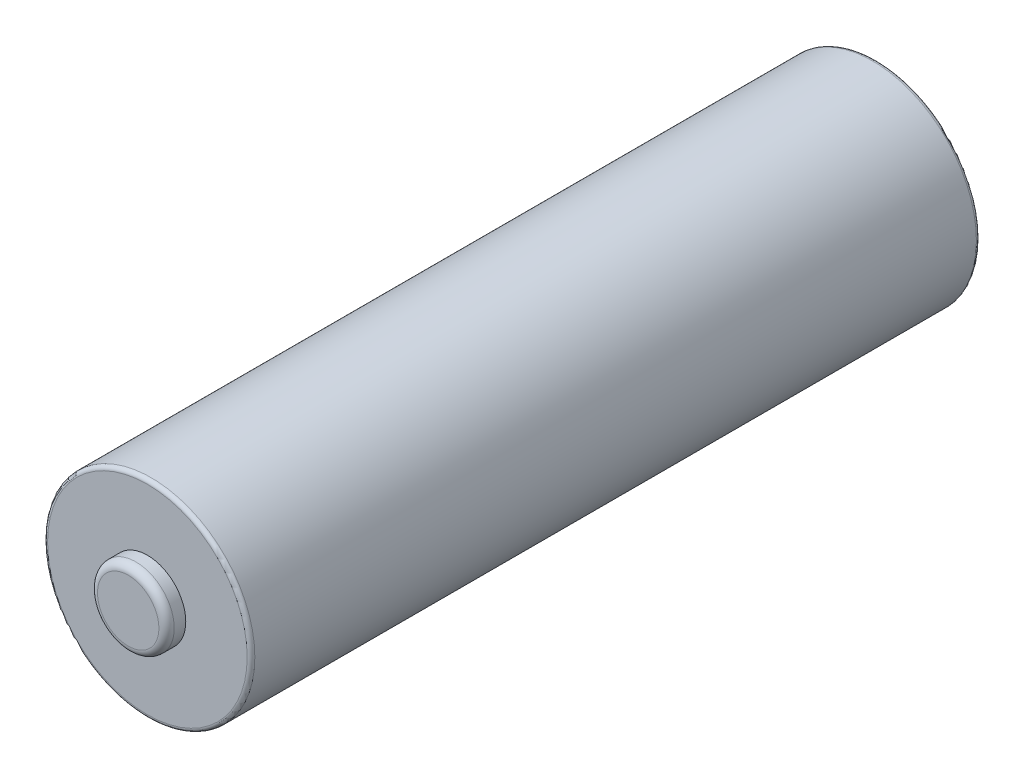
ISO-10303-21;
HEADER;
FILE_DESCRIPTION(('STEP AP214'),'2;1');
FILE_NAME('part.step','',(''),(''),'','','');
FILE_SCHEMA(('AUTOMOTIVE_DESIGN { 1 0 10303 214 1 1 1 1 }'));
ENDSEC;
DATA;
#1=APPLICATION_CONTEXT('core data for automotive mechanical design processes');
#2=APPLICATION_PROTOCOL_DEFINITION('international standard','automotive_design',2000,#1);
#3=PRODUCT_CONTEXT('',#1,'mechanical');
#4=PRODUCT('Part','Part','',(#3));
#5=PRODUCT_RELATED_PRODUCT_CATEGORY('part','',(#4));
#6=PRODUCT_DEFINITION_FORMATION('','',#4);
#7=PRODUCT_DEFINITION_CONTEXT('part definition',#1,'design');
#8=PRODUCT_DEFINITION('design','',#6,#7);
#9=PRODUCT_DEFINITION_SHAPE('','',#8);
#10=(LENGTH_UNIT() NAMED_UNIT(*) SI_UNIT(.MILLI.,.METRE.));
#11=(NAMED_UNIT(*) PLANE_ANGLE_UNIT() SI_UNIT($,.RADIAN.));
#12=(NAMED_UNIT(*) SI_UNIT($,.STERADIAN.) SOLID_ANGLE_UNIT());
#13=UNCERTAINTY_MEASURE_WITH_UNIT(LENGTH_MEASURE(1.E-05),#10,'distance_accuracy_value','');
#14=(GEOMETRIC_REPRESENTATION_CONTEXT(3) GLOBAL_UNCERTAINTY_ASSIGNED_CONTEXT((#13)) GLOBAL_UNIT_ASSIGNED_CONTEXT((#10,
#11,#12)) REPRESENTATION_CONTEXT('',''));
#15=CARTESIAN_POINT('',(0.,0.,0.));
#16=DIRECTION('',(0.,0.,1.));
#17=DIRECTION('',(1.,0.,0.));
#18=AXIS2_PLACEMENT_3D('',#15,#16,#17);
#19=CARTESIAN_POINT('',(0.,0.,48.26));
#20=DIRECTION('',(0.,0.,1.));
#21=DIRECTION('',(1.,0.,0.));
#22=AXIS2_PLACEMENT_3D('',#19,#20,#21);
#23=PLANE('',#22);
#24=CARTESIAN_POINT('',(0.,0.,48.26));
#25=DIRECTION('',(0.,0.,1.));
#26=DIRECTION('',(1.,0.,0.));
#27=AXIS2_PLACEMENT_3D('',#24,#25,#26);
#28=CIRCLE('',#27,6.604);
#29=CARTESIAN_POINT('',(6.604,0.,48.26));
#30=VERTEX_POINT('',#29);
#31=EDGE_CURVE('E44',#30,#30,#28,.T.);
#32=ORIENTED_EDGE('',*,*,#31,.T.);
#33=EDGE_LOOP('',(#32));
#34=FACE_BOUND('',#33,.T.);
#35=CARTESIAN_POINT('',(0.,0.,48.26));
#36=DIRECTION('',(0.,0.,1.));
#37=DIRECTION('',(1.,0.,0.));
#38=AXIS2_PLACEMENT_3D('',#35,#36,#37);
#39=CIRCLE('',#38,2.54);
#40=CARTESIAN_POINT('',(2.54,0.,48.26));
#41=VERTEX_POINT('',#40);
#42=EDGE_CURVE('E55',#41,#41,#39,.T.);
#43=ORIENTED_EDGE('',*,*,#42,.F.);
#44=EDGE_LOOP('',(#43));
#45=FACE_BOUND('',#44,.T.);
#46=ADVANCED_FACE('F32',(#34,#45),#23,.T.);
#47=CARTESIAN_POINT('',(0.,0.,48.26));
#48=DIRECTION('',(0.,0.,-1.));
#49=DIRECTION('',(-1.,0.,0.));
#50=AXIS2_PLACEMENT_3D('',#47,#48,#49);
#51=CYLINDRICAL_SURFACE('',#50,6.858);
#52=CARTESIAN_POINT('',(0.,0.,0.253999999999997));
#53=DIRECTION('',(0.,0.,1.));
#54=DIRECTION('',(1.,0.,0.));
#55=AXIS2_PLACEMENT_3D('',#52,#53,#54);
#56=CIRCLE('',#55,6.858);
#57=CARTESIAN_POINT('',(-6.858,0.,0.253999999999997));
#58=VERTEX_POINT('',#57);
#59=EDGE_CURVE('E49',#58,#58,#56,.T.);
#60=CARTESIAN_POINT('',(0.,0.,48.006));
#61=DIRECTION('',(0.,0.,1.));
#62=DIRECTION('',(1.,0.,0.));
#63=AXIS2_PLACEMENT_3D('',#60,#61,#62);
#64=CIRCLE('',#63,6.858);
#65=CARTESIAN_POINT('',(-6.858,0.,48.006));
#66=VERTEX_POINT('',#65);
#67=EDGE_CURVE('E52',#66,#66,#64,.F.);
#68=CARTESIAN_POINT('',(-6.858,0.,0.253999999999997));
#69=CARTESIAN_POINT('',(-6.858,0.,0.751416666666665));
#70=CARTESIAN_POINT('',(-6.858,0.,1.24883333333333));
#71=CARTESIAN_POINT('',(-6.858,0.,2.24366666666666));
#72=CARTESIAN_POINT('',(-6.858,0.,2.74108333333333));
#73=CARTESIAN_POINT('',(-6.858,0.,3.73591666666666));
#74=CARTESIAN_POINT('',(-6.858,0.,4.23333333333333));
#75=CARTESIAN_POINT('',(-6.858,0.,5.22816666666667));
#76=CARTESIAN_POINT('',(-6.858,0.,5.72558333333333));
#77=CARTESIAN_POINT('',(-6.858,0.,6.72041666666667));
#78=CARTESIAN_POINT('',(-6.858,0.,7.21783333333333));
#79=CARTESIAN_POINT('',(-6.858,0.,8.21266666666667));
#80=CARTESIAN_POINT('',(-6.858,0.,8.71008333333333));
#81=CARTESIAN_POINT('',(-6.858,0.,9.70491666666667));
#82=CARTESIAN_POINT('',(-6.858,0.,10.2023333333333));
#83=CARTESIAN_POINT('',(-6.858,0.,11.1971666666667));
#84=CARTESIAN_POINT('',(-6.858,0.,11.6945833333333));
#85=CARTESIAN_POINT('',(-6.858,0.,12.6894166666667));
#86=CARTESIAN_POINT('',(-6.858,0.,13.1868333333333));
#87=CARTESIAN_POINT('',(-6.858,0.,14.1816666666667));
#88=CARTESIAN_POINT('',(-6.858,0.,14.6790833333333));
#89=CARTESIAN_POINT('',(-6.858,0.,15.6739166666667));
#90=CARTESIAN_POINT('',(-6.858,0.,16.1713333333333));
#91=CARTESIAN_POINT('',(-6.858,0.,17.1661666666667));
#92=CARTESIAN_POINT('',(-6.858,0.,17.6635833333333));
#93=CARTESIAN_POINT('',(-6.858,0.,18.6584166666667));
#94=CARTESIAN_POINT('',(-6.858,0.,19.1558333333333));
#95=CARTESIAN_POINT('',(-6.858,0.,20.1506666666667));
#96=CARTESIAN_POINT('',(-6.858,0.,20.6480833333333));
#97=CARTESIAN_POINT('',(-6.858,0.,21.6429166666667));
#98=CARTESIAN_POINT('',(-6.858,0.,22.1403333333333));
#99=CARTESIAN_POINT('',(-6.858,0.,23.1351666666667));
#100=CARTESIAN_POINT('',(-6.858,0.,23.6325833333333));
#101=CARTESIAN_POINT('',(-6.858,0.,24.6274166666667));
#102=CARTESIAN_POINT('',(-6.858,0.,25.1248333333333));
#103=CARTESIAN_POINT('',(-6.858,0.,26.1196666666667));
#104=CARTESIAN_POINT('',(-6.858,0.,26.6170833333333));
#105=CARTESIAN_POINT('',(-6.858,0.,27.6119166666667));
#106=CARTESIAN_POINT('',(-6.858,0.,28.1093333333333));
#107=CARTESIAN_POINT('',(-6.858,0.,29.1041666666667));
#108=CARTESIAN_POINT('',(-6.858,0.,29.6015833333333));
#109=CARTESIAN_POINT('',(-6.858,0.,30.5964166666667));
#110=CARTESIAN_POINT('',(-6.858,0.,31.0938333333333));
#111=CARTESIAN_POINT('',(-6.858,0.,32.0886666666667));
#112=CARTESIAN_POINT('',(-6.858,0.,32.5860833333333));
#113=CARTESIAN_POINT('',(-6.858,0.,33.5809166666667));
#114=CARTESIAN_POINT('',(-6.858,0.,34.0783333333333));
#115=CARTESIAN_POINT('',(-6.858,0.,35.0731666666667));
#116=CARTESIAN_POINT('',(-6.858,0.,35.5705833333333));
#117=CARTESIAN_POINT('',(-6.858,0.,36.5654166666667));
#118=CARTESIAN_POINT('',(-6.858,0.,37.0628333333333));
#119=CARTESIAN_POINT('',(-6.858,0.,38.0576666666667));
#120=CARTESIAN_POINT('',(-6.858,0.,38.5550833333333));
#121=CARTESIAN_POINT('',(-6.858,0.,39.5499166666667));
#122=CARTESIAN_POINT('',(-6.858,0.,40.0473333333333));
#123=CARTESIAN_POINT('',(-6.858,0.,41.0421666666667));
#124=CARTESIAN_POINT('',(-6.858,0.,41.5395833333333));
#125=CARTESIAN_POINT('',(-6.858,0.,42.5344166666667));
#126=CARTESIAN_POINT('',(-6.858,0.,43.0318333333333));
#127=CARTESIAN_POINT('',(-6.858,0.,44.0266666666667));
#128=CARTESIAN_POINT('',(-6.858,0.,44.5240833333333));
#129=CARTESIAN_POINT('',(-6.858,0.,45.5189166666667));
#130=CARTESIAN_POINT('',(-6.858,0.,46.0163333333333));
#131=CARTESIAN_POINT('',(-6.858,0.,47.0111666666667));
#132=CARTESIAN_POINT('',(-6.858,0.,47.5085833333333));
#133=CARTESIAN_POINT('',(-6.858,0.,48.006));
#134=B_SPLINE_CURVE_WITH_KNOTS('',3,(#68,#69,#70,#71,#72,#73,#74,#75,#76,#77,#78,#79,#80,#81,
#82,#83,#84,#85,#86,#87,#88,#89,#90,#91,#92,#93,#94,#95,#96,#97,#98,#99,#100,#101,#102,#103,
#104,#105,#106,#107,#108,#109,#110,#111,#112,#113,#114,#115,#116,#117,#118,#119,#120,#121,#122,
#123,#124,#125,#126,#127,#128,#129,#130,#131,#132,#133),.UNSPECIFIED.,.F.,.F.,(4,2,2,2,2,2,2,2,
2,2,2,2,2,2,2,2,2,2,2,2,2,2,2,2,2,2,2,2,2,2,2,2,4),(0.,1.49225,2.9845,4.47675,5.969,7.46125,
8.9535,10.44575,11.938,13.43025,14.9225,16.41475,17.907,19.39925,20.8915,22.38375,23.876,
25.36825,26.8605,28.35275,29.845,31.33725,32.8295,34.32175,35.814,37.30625,38.7985,40.29075,
41.783,43.27525,44.7675,46.25975,47.752),.UNSPECIFIED.);
#135=EDGE_CURVE('BSEAM62',#58,#66,#134,.T.);
#136=ORIENTED_EDGE('',*,*,#59,.T.);
#137=ORIENTED_EDGE('',*,*,#67,.T.);
#138=ORIENTED_EDGE('',*,*,#135,.T.);
#139=ORIENTED_EDGE('',*,*,#135,.F.);
#140=EDGE_LOOP('',(#136,#138,#137,#139));
#141=FACE_BOUND('',#140,.T.);
#142=ADVANCED_FACE('F62',(#141),#51,.T.);
#143=CARTESIAN_POINT('',(0.,0.,-858.5073));
#144=DIRECTION('',(0.,0.,1.));
#145=DIRECTION('',(1.,0.,0.));
#146=AXIS2_PLACEMENT_3D('',#143,#144,#145);
#147=SPHERICAL_SURFACE('',#146,858.5327);
#148=CARTESIAN_POINT('',(0.,0.,0.));
#149=DIRECTION('',(0.,0.,1.));
#150=DIRECTION('',(1.,0.,0.));
#151=AXIS2_PLACEMENT_3D('',#148,#149,#150);
#152=CIRCLE('',#151,6.604);
#153=CARTESIAN_POINT('',(6.604,0.,0.));
#154=VERTEX_POINT('',#153);
#155=EDGE_CURVE('E36',#154,#154,#152,.F.);
#156=ORIENTED_EDGE('',*,*,#155,.T.);
#157=EDGE_LOOP('',(#156));
#158=FACE_BOUND('',#157,.T.);
#159=ADVANCED_FACE('F34',(#158),#147,.F.);
#160=CARTESIAN_POINT('',(0.,0.,0.253999999999997));
#161=DIRECTION('',(0.,0.,1.));
#162=DIRECTION('',(1.,0.,0.));
#163=AXIS2_PLACEMENT_3D('',#160,#161,#162);
#164=TOROIDAL_SURFACE('',#163,6.604,0.254);
#165=ORIENTED_EDGE('',*,*,#155,.F.);
#166=EDGE_LOOP('',(#165));
#167=FACE_BOUND('',#166,.T.);
#168=ORIENTED_EDGE('',*,*,#59,.F.);
#169=EDGE_LOOP('',(#168));
#170=FACE_BOUND('',#169,.T.);
#171=ADVANCED_FACE('F73',(#167,#170),#164,.T.);
#172=CARTESIAN_POINT('',(0.,0.,48.006));
#173=DIRECTION('',(0.,0.,1.));
#174=DIRECTION('',(1.,0.,0.));
#175=AXIS2_PLACEMENT_3D('',#172,#173,#174);
#176=TOROIDAL_SURFACE('',#175,6.604,0.254);
#177=ORIENTED_EDGE('',*,*,#67,.F.);
#178=EDGE_LOOP('',(#177));
#179=FACE_BOUND('',#178,.T.);
#180=ORIENTED_EDGE('',*,*,#31,.F.);
#181=EDGE_LOOP('',(#180));
#182=FACE_BOUND('',#181,.T.);
#183=ADVANCED_FACE('F76',(#179,#182),#176,.T.);
#184=CARTESIAN_POINT('',(0.,0.,49.53));
#185=DIRECTION('',(0.,0.,-1.));
#186=DIRECTION('',(-1.,0.,0.));
#187=AXIS2_PLACEMENT_3D('',#184,#185,#186);
#188=CYLINDRICAL_SURFACE('',#187,2.54);
#189=CARTESIAN_POINT('',(0.,0.,49.022));
#190=DIRECTION('',(0.,0.,1.));
#191=DIRECTION('',(1.,0.,0.));
#192=AXIS2_PLACEMENT_3D('',#189,#190,#191);
#193=CIRCLE('',#192,2.54);
#194=CARTESIAN_POINT('',(2.54,0.,49.022));
#195=VERTEX_POINT('',#194);
#196=EDGE_CURVE('E10',#195,#195,#193,.F.);
#197=ORIENTED_EDGE('',*,*,#196,.T.);
#198=EDGE_LOOP('',(#197));
#199=FACE_BOUND('',#198,.T.);
#200=ORIENTED_EDGE('',*,*,#42,.T.);
#201=EDGE_LOOP('',(#200));
#202=FACE_BOUND('',#201,.T.);
#203=ADVANCED_FACE('F59',(#199,#202),#188,.T.);
#204=CARTESIAN_POINT('',(0.,0.,49.53));
#205=DIRECTION('',(0.,0.,1.));
#206=DIRECTION('',(1.,0.,0.));
#207=AXIS2_PLACEMENT_3D('',#204,#205,#206);
#208=PLANE('',#207);
#209=CARTESIAN_POINT('',(0.,0.,49.53));
#210=DIRECTION('',(0.,0.,1.));
#211=DIRECTION('',(1.,0.,0.));
#212=AXIS2_PLACEMENT_3D('',#209,#210,#211);
#213=CIRCLE('',#212,2.032);
#214=CARTESIAN_POINT('',(2.032,0.,49.53));
#215=VERTEX_POINT('',#214);
#216=EDGE_CURVE('E40',#215,#215,#213,.T.);
#217=ORIENTED_EDGE('',*,*,#216,.T.);
#218=EDGE_LOOP('',(#217));
#219=FACE_BOUND('',#218,.T.);
#220=ADVANCED_FACE('F82',(#219),#208,.T.);
#221=CARTESIAN_POINT('',(0.,0.,49.022));
#222=DIRECTION('',(0.,0.,1.));
#223=DIRECTION('',(1.,0.,0.));
#224=AXIS2_PLACEMENT_3D('',#221,#222,#223);
#225=TOROIDAL_SURFACE('',#224,2.032,0.508);
#226=ORIENTED_EDGE('',*,*,#196,.F.);
#227=EDGE_LOOP('',(#226));
#228=FACE_BOUND('',#227,.T.);
#229=ORIENTED_EDGE('',*,*,#216,.F.);
#230=EDGE_LOOP('',(#229));
#231=FACE_BOUND('',#230,.T.);
#232=ADVANCED_FACE('F80',(#228,#231),#225,.T.);
#233=CLOSED_SHELL('',(#46,#142,#159,#171,#183,#203,#220,#232));
#234=MANIFOLD_SOLID_BREP('B2',#233);
#235=ADVANCED_BREP_SHAPE_REPRESENTATION('',(#18,#234),#14);
#236=SHAPE_DEFINITION_REPRESENTATION(#9,#235);
ENDSEC;
END-ISO-10303-21;
